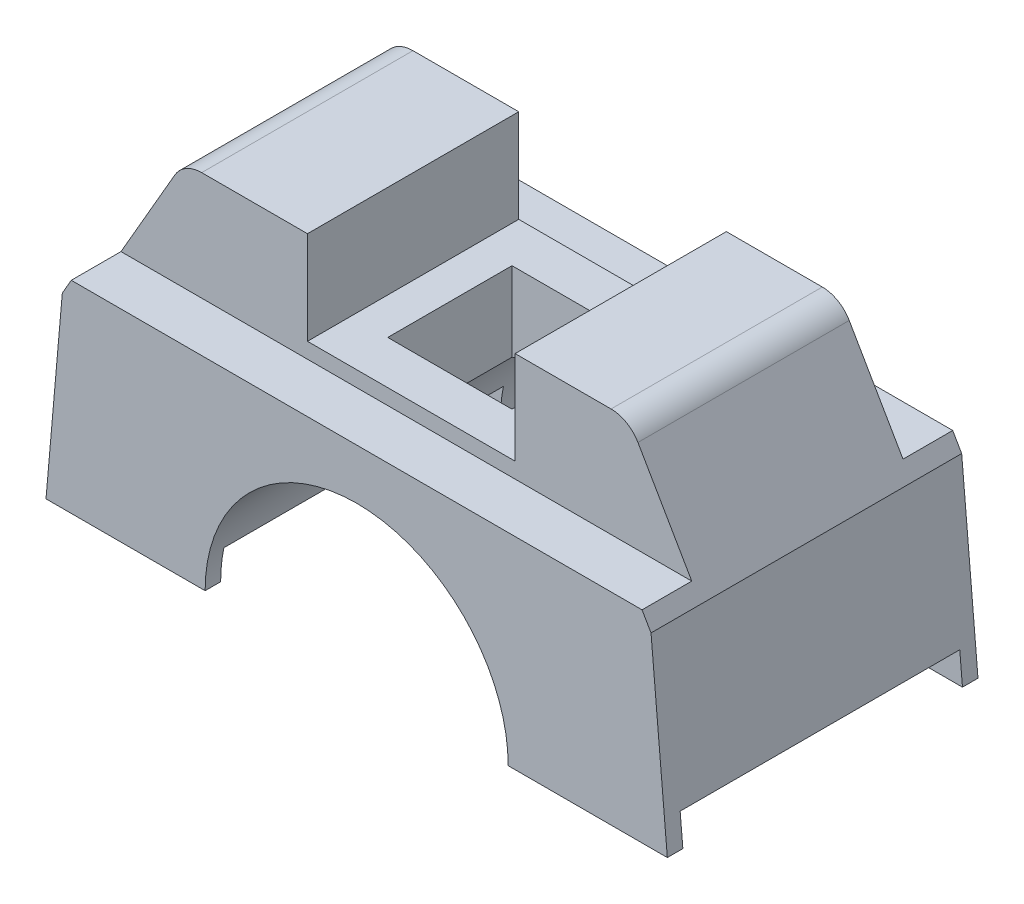
ISO-10303-21;
HEADER;
FILE_DESCRIPTION(('STEP AP214'),'2;1');
FILE_NAME('part.step','',(''),(''),'','','');
FILE_SCHEMA(('AUTOMOTIVE_DESIGN { 1 0 10303 214 1 1 1 1 }'));
ENDSEC;
DATA;
#1=APPLICATION_CONTEXT('core data for automotive mechanical design processes');
#2=APPLICATION_PROTOCOL_DEFINITION('international standard','automotive_design',2000,#1);
#3=PRODUCT_CONTEXT('',#1,'mechanical');
#4=PRODUCT('Part','Part','',(#3));
#5=PRODUCT_RELATED_PRODUCT_CATEGORY('part','',(#4));
#6=PRODUCT_DEFINITION_FORMATION('','',#4);
#7=PRODUCT_DEFINITION_CONTEXT('part definition',#1,'design');
#8=PRODUCT_DEFINITION('design','',#6,#7);
#9=PRODUCT_DEFINITION_SHAPE('','',#8);
#10=(LENGTH_UNIT() NAMED_UNIT(*) SI_UNIT(.MILLI.,.METRE.));
#11=(NAMED_UNIT(*) PLANE_ANGLE_UNIT() SI_UNIT($,.RADIAN.));
#12=(NAMED_UNIT(*) SI_UNIT($,.STERADIAN.) SOLID_ANGLE_UNIT());
#13=UNCERTAINTY_MEASURE_WITH_UNIT(LENGTH_MEASURE(1.E-05),#10,'distance_accuracy_value','');
#14=(GEOMETRIC_REPRESENTATION_CONTEXT(3) GLOBAL_UNCERTAINTY_ASSIGNED_CONTEXT((#13)) GLOBAL_UNIT_ASSIGNED_CONTEXT((#10,
#11,#12)) REPRESENTATION_CONTEXT('',''));
#15=CARTESIAN_POINT('',(0.,0.,0.));
#16=DIRECTION('',(0.,0.,1.));
#17=DIRECTION('',(1.,0.,0.));
#18=AXIS2_PLACEMENT_3D('',#15,#16,#17);
#19=CARTESIAN_POINT('',(0.,0.,25.));
#20=DIRECTION('',(0.,0.,-1.));
#21=DIRECTION('',(-1.,0.,0.));
#22=AXIS2_PLACEMENT_3D('',#19,#20,#21);
#23=CYLINDRICAL_SURFACE('',#22,24.39);
#24=DIRECTION('',(0.,0.,-1.));
#25=VECTOR('',#24,1.);
#26=CARTESIAN_POINT('',(-10.,22.2457209368454,25.));
#27=LINE('',#26,#25);
#28=CARTESIAN_POINT('',(-10.,22.2457209368454,10.));
#29=VERTEX_POINT('',#28);
#30=CARTESIAN_POINT('',(-10.,22.2457209368454,-10.));
#31=VERTEX_POINT('',#30);
#32=EDGE_CURVE('E321',#29,#31,#27,.T.);
#33=ORIENTED_EDGE('',*,*,#32,.F.);
#34=CARTESIAN_POINT('',(0.,0.,10.));
#35=DIRECTION('',(0.,0.,1.));
#36=DIRECTION('',(1.,0.,0.));
#37=AXIS2_PLACEMENT_3D('',#34,#35,#36);
#38=CIRCLE('',#37,24.39);
#39=CARTESIAN_POINT('',(10.,22.2457209368454,10.));
#40=VERTEX_POINT('',#39);
#41=EDGE_CURVE('E301',#40,#29,#38,.T.);
#42=ORIENTED_EDGE('',*,*,#41,.F.);
#43=DIRECTION('',(0.,0.,-1.));
#44=VECTOR('',#43,1.);
#45=CARTESIAN_POINT('',(10.,22.2457209368454,25.));
#46=LINE('',#45,#44);
#47=CARTESIAN_POINT('',(9.99999999999999,22.2457209368454,-10.));
#48=VERTEX_POINT('',#47);
#49=EDGE_CURVE('E314',#48,#40,#46,.F.);
#50=ORIENTED_EDGE('',*,*,#49,.F.);
#51=CARTESIAN_POINT('',(0.,0.,-10.));
#52=DIRECTION('',(0.,0.,-1.));
#53=DIRECTION('',(-1.,0.,0.));
#54=AXIS2_PLACEMENT_3D('',#51,#52,#53);
#55=CIRCLE('',#54,24.39);
#56=EDGE_CURVE('E318',#31,#48,#55,.T.);
#57=ORIENTED_EDGE('',*,*,#56,.F.);
#58=EDGE_LOOP('',(#33,#42,#50,#57));
#59=FACE_BOUND('',#58,.T.);
#60=DIRECTION('',(0.,0.,-1.));
#61=VECTOR('',#60,1.);
#62=CARTESIAN_POINT('',(-23.871994051608,4.99999999999917,25.));
#63=LINE('',#62,#61);
#64=CARTESIAN_POINT('',(-23.871994051608,4.99999999999917,22.5));
#65=VERTEX_POINT('',#64);
#66=CARTESIAN_POINT('',(-23.871994051608,4.99999999999917,-22.5));
#67=VERTEX_POINT('',#66);
#68=EDGE_CURVE('E56',#65,#67,#63,.T.);
#69=ORIENTED_EDGE('',*,*,#68,.T.);
#70=CARTESIAN_POINT('',(0.,0.,-22.5));
#71=DIRECTION('',(0.,0.,1.));
#72=DIRECTION('',(1.,0.,0.));
#73=AXIS2_PLACEMENT_3D('',#70,#71,#72);
#74=CIRCLE('',#73,24.39);
#75=CARTESIAN_POINT('',(-24.39,0.,-22.5));
#76=VERTEX_POINT('',#75);
#77=EDGE_CURVE('E284',#67,#76,#74,.T.);
#78=ORIENTED_EDGE('',*,*,#77,.T.);
#79=DIRECTION('',(0.,0.,-1.));
#80=VECTOR('',#79,1.);
#81=CARTESIAN_POINT('',(-24.39,0.,25.));
#82=LINE('',#81,#80);
#83=CARTESIAN_POINT('',(-24.39,0.,-25.));
#84=VERTEX_POINT('',#83);
#85=EDGE_CURVE('E455',#76,#84,#82,.T.);
#86=ORIENTED_EDGE('',*,*,#85,.T.);
#87=CARTESIAN_POINT('',(0.,0.,-25.));
#88=DIRECTION('',(0.,0.,1.));
#89=DIRECTION('',(1.,0.,0.));
#90=AXIS2_PLACEMENT_3D('',#87,#88,#89);
#91=CIRCLE('',#90,24.39);
#92=CARTESIAN_POINT('',(24.39,-4.06410084483682E-13,-25.));
#93=VERTEX_POINT('',#92);
#94=EDGE_CURVE('E425',#93,#84,#91,.T.);
#95=ORIENTED_EDGE('',*,*,#94,.F.);
#96=DIRECTION('',(0.,0.,-1.));
#97=VECTOR('',#96,1.);
#98=CARTESIAN_POINT('',(24.39,-4.06410084483682E-13,25.));
#99=LINE('',#98,#97);
#100=CARTESIAN_POINT('',(24.39,-4.06410084483682E-13,-22.5));
#101=VERTEX_POINT('',#100);
#102=EDGE_CURVE('E247',#101,#93,#99,.T.);
#103=ORIENTED_EDGE('',*,*,#102,.F.);
#104=CARTESIAN_POINT('',(23.871994051608,4.99999999999917,-22.5));
#105=VERTEX_POINT('',#104);
#106=EDGE_CURVE('E287',#101,#105,#74,.T.);
#107=ORIENTED_EDGE('',*,*,#106,.T.);
#108=DIRECTION('',(0.,0.,-1.));
#109=VECTOR('',#108,1.);
#110=CARTESIAN_POINT('',(23.871994051608,4.99999999999917,25.));
#111=LINE('',#110,#109);
#112=CARTESIAN_POINT('',(23.871994051608,4.99999999999917,22.5));
#113=VERTEX_POINT('',#112);
#114=EDGE_CURVE('E291',#105,#113,#111,.F.);
#115=ORIENTED_EDGE('',*,*,#114,.T.);
#116=CARTESIAN_POINT('',(0.,0.,22.5));
#117=DIRECTION('',(0.,0.,-1.));
#118=DIRECTION('',(-1.,0.,0.));
#119=AXIS2_PLACEMENT_3D('',#116,#117,#118);
#120=CIRCLE('',#119,24.39);
#121=CARTESIAN_POINT('',(24.39,-4.06410084483682E-13,22.5));
#122=VERTEX_POINT('',#121);
#123=EDGE_CURVE('E266',#113,#122,#120,.T.);
#124=ORIENTED_EDGE('',*,*,#123,.T.);
#125=CARTESIAN_POINT('',(24.39,-4.06410084483682E-13,25.));
#126=VERTEX_POINT('',#125);
#127=EDGE_CURVE('E254',#126,#122,#99,.T.);
#128=ORIENTED_EDGE('',*,*,#127,.F.);
#129=CARTESIAN_POINT('',(0.,0.,25.));
#130=DIRECTION('',(0.,0.,1.));
#131=DIRECTION('',(1.,0.,0.));
#132=AXIS2_PLACEMENT_3D('',#129,#130,#131);
#133=CIRCLE('',#132,24.39);
#134=CARTESIAN_POINT('',(-24.39,0.,25.));
#135=VERTEX_POINT('',#134);
#136=EDGE_CURVE('E426',#126,#135,#133,.T.);
#137=ORIENTED_EDGE('',*,*,#136,.T.);
#138=CARTESIAN_POINT('',(-24.39,0.,22.5));
#139=VERTEX_POINT('',#138);
#140=EDGE_CURVE('E485',#135,#139,#82,.T.);
#141=ORIENTED_EDGE('',*,*,#140,.T.);
#142=EDGE_CURVE('E61',#139,#65,#120,.T.);
#143=ORIENTED_EDGE('',*,*,#142,.T.);
#144=EDGE_LOOP('',(#69,#78,#86,#95,#103,#107,#115,#124,#128,#137,#141,#143));
#145=FACE_BOUND('',#144,.T.);
#146=ADVANCED_FACE('F41',(#59,#145),#23,.F.);
#147=CARTESIAN_POINT('',(0.,0.,25.));
#148=DIRECTION('',(0.,-1.,0.));
#149=DIRECTION('',(1.,0.,0.));
#150=AXIS2_PLACEMENT_3D('',#147,#148,#149);
#151=PLANE('',#150);
#152=DIRECTION('',(0.,0.,-1.));
#153=VECTOR('',#152,1.);
#154=CARTESIAN_POINT('',(49.9999999999999,-8.33149004681594E-13,25.));
#155=LINE('',#154,#153);
#156=CARTESIAN_POINT('',(49.9999999999999,-8.33149004681594E-13,-22.5));
#157=VERTEX_POINT('',#156);
#158=CARTESIAN_POINT('',(49.9999999999999,-8.33149004681594E-13,-25.));
#159=VERTEX_POINT('',#158);
#160=EDGE_CURVE('E248',#157,#159,#155,.T.);
#161=ORIENTED_EDGE('',*,*,#160,.F.);
#162=DIRECTION('',(-1.,0.,0.));
#163=VECTOR('',#162,1.);
#164=CARTESIAN_POINT('',(210.508064450509,-8.33149004681594E-13,-22.5));
#165=LINE('',#164,#163);
#166=EDGE_CURVE('E273',#157,#101,#165,.T.);
#167=ORIENTED_EDGE('',*,*,#166,.T.);
#168=ORIENTED_EDGE('',*,*,#102,.T.);
#169=DIRECTION('',(-1.,0.,0.));
#170=VECTOR('',#169,1.);
#171=CARTESIAN_POINT('',(0.,0.,-25.));
#172=LINE('',#171,#170);
#173=EDGE_CURVE('E459',#159,#93,#172,.T.);
#174=ORIENTED_EDGE('',*,*,#173,.F.);
#175=EDGE_LOOP('',(#161,#167,#168,#174));
#176=FACE_BOUND('',#175,.T.);
#177=ADVANCED_FACE('F554',(#176),#151,.T.);
#178=CARTESIAN_POINT('',(49.6201938253051,4.34120444167299,25.));
#179=DIRECTION('',(-0.996194698091746,-0.087155742747653,0.));
#180=DIRECTION('',(0.087155742747653,-0.996194698091746,0.));
#181=AXIS2_PLACEMENT_3D('',#178,#179,#180);
#182=PLANE('',#181);
#183=DIRECTION('',(-0.087155742747653,0.996194698091746,0.));
#184=VECTOR('',#183,1.);
#185=CARTESIAN_POINT('',(49.6201938253051,4.34120444167299,-22.5));
#186=LINE('',#185,#184);
#187=CARTESIAN_POINT('',(49.5625566823704,4.99999999999917,-22.5));
#188=VERTEX_POINT('',#187);
#189=EDGE_CURVE('E280',#157,#188,#186,.T.);
#190=ORIENTED_EDGE('',*,*,#189,.F.);
#191=ORIENTED_EDGE('',*,*,#160,.T.);
#192=DIRECTION('',(-0.087155742747653,0.996194698091746,0.));
#193=VECTOR('',#192,1.);
#194=CARTESIAN_POINT('',(49.6201938253051,4.34120444167299,-25.));
#195=LINE('',#194,#193);
#196=CARTESIAN_POINT('',(47.3753400942223,30.,-25.));
#197=VERTEX_POINT('',#196);
#198=EDGE_CURVE('E463',#159,#197,#195,.T.);
#199=ORIENTED_EDGE('',*,*,#198,.T.);
#200=DIRECTION('',(0.,0.,-1.));
#201=VECTOR('',#200,1.);
#202=CARTESIAN_POINT('',(47.3753400942223,30.,25.));
#203=LINE('',#202,#201);
#204=CARTESIAN_POINT('',(47.3753400942223,30.,25.));
#205=VERTEX_POINT('',#204);
#206=EDGE_CURVE('E504',#205,#197,#203,.T.);
#207=ORIENTED_EDGE('',*,*,#206,.F.);
#208=DIRECTION('',(-0.087155742747653,0.996194698091746,0.));
#209=VECTOR('',#208,1.);
#210=CARTESIAN_POINT('',(49.6201938253051,4.34120444167299,25.));
#211=LINE('',#210,#209);
#212=CARTESIAN_POINT('',(49.9999999999999,-8.33149004681594E-13,25.));
#213=VERTEX_POINT('',#212);
#214=EDGE_CURVE('E242',#213,#205,#211,.T.);
#215=ORIENTED_EDGE('',*,*,#214,.F.);
#216=CARTESIAN_POINT('',(50.,-8.33149004681594E-13,22.5));
#217=VERTEX_POINT('',#216);
#218=EDGE_CURVE('E235',#213,#217,#155,.T.);
#219=ORIENTED_EDGE('',*,*,#218,.T.);
#220=DIRECTION('',(0.087155742747653,-0.996194698091746,0.));
#221=VECTOR('',#220,1.);
#222=CARTESIAN_POINT('',(49.6201938253051,4.34120444167299,22.5));
#223=LINE('',#222,#221);
#224=CARTESIAN_POINT('',(49.5625566823704,4.99999999999917,22.5));
#225=VERTEX_POINT('',#224);
#226=EDGE_CURVE('E239',#225,#217,#223,.T.);
#227=ORIENTED_EDGE('',*,*,#226,.F.);
#228=DIRECTION('',(0.,0.,1.));
#229=VECTOR('',#228,1.);
#230=CARTESIAN_POINT('',(49.5625566823704,4.99999999999917,25.));
#231=LINE('',#230,#229);
#232=EDGE_CURVE('E288',#188,#225,#231,.T.);
#233=ORIENTED_EDGE('',*,*,#232,.F.);
#234=EDGE_LOOP('',(#190,#191,#199,#207,#215,#219,#227,#233));
#235=FACE_BOUND('',#234,.T.);
#236=ADVANCED_FACE('F237',(#235),#182,.F.);
#237=CARTESIAN_POINT('',(-49.6201938253052,4.34120444167354,25.));
#238=DIRECTION('',(-0.996194698091745,0.0871557427476638,0.));
#239=DIRECTION('',(-0.0871557427476638,-0.996194698091745,0.));
#240=AXIS2_PLACEMENT_3D('',#237,#238,#239);
#241=PLANE('',#240);
#242=DIRECTION('',(0.,0.,-1.));
#243=VECTOR('',#242,1.);
#244=CARTESIAN_POINT('',(-50.0000000000001,0.,25.));
#245=LINE('',#244,#243);
#246=CARTESIAN_POINT('',(-50.0000000000001,0.,-22.5));
#247=VERTEX_POINT('',#246);
#248=CARTESIAN_POINT('',(-50.0000000000001,0.,-25.));
#249=VERTEX_POINT('',#248);
#250=EDGE_CURVE('E488',#247,#249,#245,.T.);
#251=ORIENTED_EDGE('',*,*,#250,.F.);
#252=DIRECTION('',(0.0871557427476638,0.996194698091745,0.));
#253=VECTOR('',#252,1.);
#254=CARTESIAN_POINT('',(-49.6201938253052,4.34120444167354,-22.5));
#255=LINE('',#254,#253);
#256=CARTESIAN_POINT('',(-49.5625566823705,4.99999999999917,-22.5));
#257=VERTEX_POINT('',#256);
#258=EDGE_CURVE('E277',#247,#257,#255,.T.);
#259=ORIENTED_EDGE('',*,*,#258,.T.);
#260=DIRECTION('',(0.,0.,1.));
#261=VECTOR('',#260,1.);
#262=CARTESIAN_POINT('',(-49.5625566823705,4.99999999999917,25.));
#263=LINE('',#262,#261);
#264=CARTESIAN_POINT('',(-49.5625566823705,4.99999999999917,22.5));
#265=VERTEX_POINT('',#264);
#266=EDGE_CURVE('E11',#257,#265,#263,.T.);
#267=ORIENTED_EDGE('',*,*,#266,.T.);
#268=DIRECTION('',(-0.0871557427476638,-0.996194698091745,0.));
#269=VECTOR('',#268,1.);
#270=CARTESIAN_POINT('',(-49.6201938253052,4.34120444167354,22.5));
#271=LINE('',#270,#269);
#272=CARTESIAN_POINT('',(-50.0000000000001,-8.33149004681594E-13,22.5));
#273=VERTEX_POINT('',#272);
#274=EDGE_CURVE('E267',#265,#273,#271,.T.);
#275=ORIENTED_EDGE('',*,*,#274,.T.);
#276=CARTESIAN_POINT('',(-50.0000000000001,0.,25.));
#277=VERTEX_POINT('',#276);
#278=EDGE_CURVE('E489',#277,#273,#245,.T.);
#279=ORIENTED_EDGE('',*,*,#278,.F.);
#280=DIRECTION('',(0.0871557427476638,0.996194698091745,0.));
#281=VECTOR('',#280,1.);
#282=CARTESIAN_POINT('',(-49.6201938253052,4.34120444167354,25.));
#283=LINE('',#282,#281);
#284=CARTESIAN_POINT('',(-47.3753400942222,30.,25.));
#285=VERTEX_POINT('',#284);
#286=EDGE_CURVE('E447',#277,#285,#283,.T.);
#287=ORIENTED_EDGE('',*,*,#286,.T.);
#288=DIRECTION('',(0.,0.,-1.));
#289=VECTOR('',#288,1.);
#290=CARTESIAN_POINT('',(-47.3753400942222,30.,25.));
#291=LINE('',#290,#289);
#292=CARTESIAN_POINT('',(-47.3753400942222,30.,-25.));
#293=VERTEX_POINT('',#292);
#294=EDGE_CURVE('E492',#285,#293,#291,.T.);
#295=ORIENTED_EDGE('',*,*,#294,.T.);
#296=DIRECTION('',(0.0871557427476638,0.996194698091745,0.));
#297=VECTOR('',#296,1.);
#298=CARTESIAN_POINT('',(-49.6201938253052,4.34120444167354,-25.));
#299=LINE('',#298,#297);
#300=EDGE_CURVE('E478',#249,#293,#299,.T.);
#301=ORIENTED_EDGE('',*,*,#300,.F.);
#302=EDGE_LOOP('',(#251,#259,#267,#275,#279,#287,#295,#301));
#303=FACE_BOUND('',#302,.T.);
#304=ADVANCED_FACE('F562',(#303),#241,.T.);
#305=CARTESIAN_POINT('',(0.,0.,25.));
#306=DIRECTION('',(0.,-1.,0.));
#307=DIRECTION('',(1.,0.,0.));
#308=AXIS2_PLACEMENT_3D('',#305,#306,#307);
#309=PLANE('',#308);
#310=ORIENTED_EDGE('',*,*,#85,.F.);
#311=EDGE_CURVE('E635',#76,#247,#165,.T.);
#312=ORIENTED_EDGE('',*,*,#311,.T.);
#313=ORIENTED_EDGE('',*,*,#250,.T.);
#314=DIRECTION('',(-1.,0.,0.));
#315=VECTOR('',#314,1.);
#316=CARTESIAN_POINT('',(0.,0.,-25.));
#317=LINE('',#316,#315);
#318=EDGE_CURVE('E431',#84,#249,#317,.T.);
#319=ORIENTED_EDGE('',*,*,#318,.F.);
#320=EDGE_LOOP('',(#310,#312,#313,#319));
#321=FACE_BOUND('',#320,.T.);
#322=ADVANCED_FACE('F575',(#321),#309,.T.);
#323=CARTESIAN_POINT('',(0.,32.5,25.));
#324=DIRECTION('',(0.,1.,0.));
#325=DIRECTION('',(0.,0.,1.));
#326=AXIS2_PLACEMENT_3D('',#323,#324,#325);
#327=PLANE('',#326);
#328=DIRECTION('',(0.,0.,-1.));
#329=VECTOR('',#328,1.);
#330=CARTESIAN_POINT('',(-45.9319644212481,32.5,25.));
#331=LINE('',#330,#329);
#332=CARTESIAN_POINT('',(-45.9319644212481,32.5,-17.));
#333=VERTEX_POINT('',#332);
#334=CARTESIAN_POINT('',(-45.9319644212481,32.5,-25.));
#335=VERTEX_POINT('',#334);
#336=EDGE_CURVE('E495',#333,#335,#331,.T.);
#337=ORIENTED_EDGE('',*,*,#336,.F.);
#338=DIRECTION('',(1.,0.,0.));
#339=VECTOR('',#338,1.);
#340=CARTESIAN_POINT('',(0.,32.5,-17.));
#341=LINE('',#340,#339);
#342=CARTESIAN_POINT('',(45.9319644212483,32.5,-17.));
#343=VERTEX_POINT('',#342);
#344=EDGE_CURVE('E372',#333,#343,#341,.T.);
#345=ORIENTED_EDGE('',*,*,#344,.T.);
#346=DIRECTION('',(0.,0.,-1.));
#347=VECTOR('',#346,1.);
#348=CARTESIAN_POINT('',(45.9319644212483,32.5,25.));
#349=LINE('',#348,#347);
#350=CARTESIAN_POINT('',(45.9319644212483,32.5,-25.));
#351=VERTEX_POINT('',#350);
#352=EDGE_CURVE('E500',#343,#351,#349,.T.);
#353=ORIENTED_EDGE('',*,*,#352,.T.);
#354=DIRECTION('',(1.,0.,0.));
#355=VECTOR('',#354,1.);
#356=CARTESIAN_POINT('',(0.,32.5,-25.));
#357=LINE('',#356,#355);
#358=EDGE_CURVE('E470',#335,#351,#357,.T.);
#359=ORIENTED_EDGE('',*,*,#358,.F.);
#360=EDGE_LOOP('',(#337,#345,#353,#359));
#361=FACE_BOUND('',#360,.T.);
#362=ADVANCED_FACE('F567',(#361),#327,.T.);
#363=DIRECTION('',(-1.,0.,0.));
#364=VECTOR('',#363,1.);
#365=CARTESIAN_POINT('',(210.508064450509,-8.33149004681594E-13,22.5));
#366=LINE('',#365,#364);
#367=EDGE_CURVE('E252',#217,#122,#366,.T.);
#368=ORIENTED_EDGE('',*,*,#367,.F.);
#369=ORIENTED_EDGE('',*,*,#218,.F.);
#370=DIRECTION('',(-1.,0.,0.));
#371=VECTOR('',#370,1.);
#372=CARTESIAN_POINT('',(0.,0.,25.));
#373=LINE('',#372,#371);
#374=EDGE_CURVE('E430',#213,#126,#373,.T.);
#375=ORIENTED_EDGE('',*,*,#374,.T.);
#376=ORIENTED_EDGE('',*,*,#127,.T.);
#377=EDGE_LOOP('',(#368,#369,#375,#376));
#378=FACE_BOUND('',#377,.T.);
#379=ADVANCED_FACE('F253',(#378),#151,.T.);
#380=CARTESIAN_POINT('',(48.5218861274333,28.014124017262,25.));
#381=DIRECTION('',(-0.866025403784438,-0.500000000000001,0.));
#382=DIRECTION('',(0.500000000000001,-0.866025403784438,0.));
#383=AXIS2_PLACEMENT_3D('',#380,#381,#382);
#384=PLANE('',#383);
#385=DIRECTION('',(-0.500000000000001,0.866025403784438,0.));
#386=VECTOR('',#385,1.);
#387=CARTESIAN_POINT('',(48.5218861274333,28.014124017262,-25.));
#388=LINE('',#387,#386);
#389=EDGE_CURVE('E466',#197,#351,#388,.T.);
#390=ORIENTED_EDGE('',*,*,#389,.T.);
#391=ORIENTED_EDGE('',*,*,#352,.F.);
#392=DIRECTION('',(-0.500000000000001,0.866025403784438,0.));
#393=VECTOR('',#392,1.);
#394=CARTESIAN_POINT('',(48.5218861274333,28.014124017262,-17.));
#395=LINE('',#394,#393);
#396=CARTESIAN_POINT('',(37.2717103834038,47.5,-17.));
#397=VERTEX_POINT('',#396);
#398=EDGE_CURVE('E375',#343,#397,#395,.T.);
#399=ORIENTED_EDGE('',*,*,#398,.T.);
#400=DIRECTION('',(0.,0.,-1.));
#401=VECTOR('',#400,1.);
#402=CARTESIAN_POINT('',(37.2717103834038,47.5,17.));
#403=LINE('',#402,#401);
#404=CARTESIAN_POINT('',(37.2717103834038,47.5,17.));
#405=VERTEX_POINT('',#404);
#406=EDGE_CURVE('E418',#405,#397,#403,.T.);
#407=ORIENTED_EDGE('',*,*,#406,.F.);
#408=DIRECTION('',(-0.500000000000001,0.866025403784438,0.));
#409=VECTOR('',#408,1.);
#410=CARTESIAN_POINT('',(48.5218861274333,28.014124017262,17.));
#411=LINE('',#410,#409);
#412=CARTESIAN_POINT('',(45.9319644212483,32.5,17.));
#413=VERTEX_POINT('',#412);
#414=EDGE_CURVE('E338',#413,#405,#411,.T.);
#415=ORIENTED_EDGE('',*,*,#414,.F.);
#416=CARTESIAN_POINT('',(45.9319644212483,32.5,25.));
#417=VERTEX_POINT('',#416);
#418=EDGE_CURVE('E501',#417,#413,#349,.T.);
#419=ORIENTED_EDGE('',*,*,#418,.F.);
#420=DIRECTION('',(-0.500000000000001,0.866025403784438,0.));
#421=VECTOR('',#420,1.);
#422=CARTESIAN_POINT('',(48.5218861274333,28.014124017262,25.));
#423=LINE('',#422,#421);
#424=EDGE_CURVE('E436',#205,#417,#423,.T.);
#425=ORIENTED_EDGE('',*,*,#424,.F.);
#426=ORIENTED_EDGE('',*,*,#206,.T.);
#427=EDGE_LOOP('',(#390,#391,#399,#407,#415,#419,#425,#426));
#428=FACE_BOUND('',#427,.T.);
#429=ADVANCED_FACE('F566',(#428),#384,.F.);
#430=DIRECTION('',(1.,0.,0.));
#431=VECTOR('',#430,1.);
#432=CARTESIAN_POINT('',(0.,32.5,17.));
#433=LINE('',#432,#431);
#434=CARTESIAN_POINT('',(-45.9319644212481,32.5,17.));
#435=VERTEX_POINT('',#434);
#436=EDGE_CURVE('E334',#435,#413,#433,.T.);
#437=ORIENTED_EDGE('',*,*,#436,.F.);
#438=CARTESIAN_POINT('',(-45.9319644212481,32.5,25.));
#439=VERTEX_POINT('',#438);
#440=EDGE_CURVE('E496',#439,#435,#331,.T.);
#441=ORIENTED_EDGE('',*,*,#440,.F.);
#442=DIRECTION('',(1.,0.,0.));
#443=VECTOR('',#442,1.);
#444=CARTESIAN_POINT('',(0.,32.5,25.));
#445=LINE('',#444,#443);
#446=EDGE_CURVE('E439',#439,#417,#445,.T.);
#447=ORIENTED_EDGE('',*,*,#446,.T.);
#448=ORIENTED_EDGE('',*,*,#418,.T.);
#449=EDGE_LOOP('',(#437,#441,#447,#448));
#450=FACE_BOUND('',#449,.T.);
#451=ADVANCED_FACE('F572',(#450),#327,.T.);
#452=CARTESIAN_POINT('',(-48.5218861274331,28.0141240172622,25.));
#453=DIRECTION('',(-0.866025403784436,0.500000000000004,0.));
#454=DIRECTION('',(-0.500000000000004,-0.866025403784436,0.));
#455=AXIS2_PLACEMENT_3D('',#452,#453,#454);
#456=PLANE('',#455);
#457=DIRECTION('',(0.500000000000004,0.866025403784436,0.));
#458=VECTOR('',#457,1.);
#459=CARTESIAN_POINT('',(-48.5218861274331,28.0141240172622,-25.));
#460=LINE('',#459,#458);
#461=EDGE_CURVE('E474',#293,#335,#460,.T.);
#462=ORIENTED_EDGE('',*,*,#461,.F.);
#463=ORIENTED_EDGE('',*,*,#294,.F.);
#464=DIRECTION('',(0.500000000000004,0.866025403784436,0.));
#465=VECTOR('',#464,1.);
#466=CARTESIAN_POINT('',(-48.5218861274331,28.0141240172622,25.));
#467=LINE('',#466,#465);
#468=EDGE_CURVE('E443',#285,#439,#467,.T.);
#469=ORIENTED_EDGE('',*,*,#468,.T.);
#470=ORIENTED_EDGE('',*,*,#440,.T.);
#471=DIRECTION('',(0.500000000000004,0.866025403784436,0.));
#472=VECTOR('',#471,1.);
#473=CARTESIAN_POINT('',(-48.5218861274331,28.0141240172622,17.));
#474=LINE('',#473,#472);
#475=CARTESIAN_POINT('',(-37.2717103834036,47.5,17.));
#476=VERTEX_POINT('',#475);
#477=EDGE_CURVE('E329',#435,#476,#474,.T.);
#478=ORIENTED_EDGE('',*,*,#477,.T.);
#479=DIRECTION('',(0.,0.,-1.));
#480=VECTOR('',#479,1.);
#481=CARTESIAN_POINT('',(-37.2717103834036,47.5,17.));
#482=LINE('',#481,#480);
#483=CARTESIAN_POINT('',(-37.2717103834036,47.5,-17.));
#484=VERTEX_POINT('',#483);
#485=EDGE_CURVE('E422',#476,#484,#482,.T.);
#486=ORIENTED_EDGE('',*,*,#485,.T.);
#487=DIRECTION('',(0.500000000000004,0.866025403784436,0.));
#488=VECTOR('',#487,1.);
#489=CARTESIAN_POINT('',(-48.5218861274331,28.0141240172622,-17.));
#490=LINE('',#489,#488);
#491=EDGE_CURVE('E368',#333,#484,#490,.T.);
#492=ORIENTED_EDGE('',*,*,#491,.F.);
#493=ORIENTED_EDGE('',*,*,#336,.T.);
#494=EDGE_LOOP('',(#462,#463,#469,#470,#478,#486,#492,#493));
#495=FACE_BOUND('',#494,.T.);
#496=ADVANCED_FACE('F586',(#495),#456,.T.);
#497=EDGE_CURVE('E259',#139,#273,#366,.T.);
#498=ORIENTED_EDGE('',*,*,#497,.F.);
#499=ORIENTED_EDGE('',*,*,#140,.F.);
#500=DIRECTION('',(-1.,0.,0.));
#501=VECTOR('',#500,1.);
#502=CARTESIAN_POINT('',(0.,0.,25.));
#503=LINE('',#502,#501);
#504=EDGE_CURVE('E451',#135,#277,#503,.T.);
#505=ORIENTED_EDGE('',*,*,#504,.T.);
#506=ORIENTED_EDGE('',*,*,#278,.T.);
#507=EDGE_LOOP('',(#498,#499,#505,#506));
#508=FACE_BOUND('',#507,.T.);
#509=ADVANCED_FACE('F583',(#508),#309,.T.);
#510=CARTESIAN_POINT('',(0.,0.,25.));
#511=DIRECTION('',(0.,0.,1.));
#512=DIRECTION('',(1.,0.,0.));
#513=AXIS2_PLACEMENT_3D('',#510,#511,#512);
#514=PLANE('',#513);
#515=ORIENTED_EDGE('',*,*,#136,.F.);
#516=ORIENTED_EDGE('',*,*,#374,.F.);
#517=ORIENTED_EDGE('',*,*,#214,.T.);
#518=ORIENTED_EDGE('',*,*,#424,.T.);
#519=ORIENTED_EDGE('',*,*,#446,.F.);
#520=ORIENTED_EDGE('',*,*,#468,.F.);
#521=ORIENTED_EDGE('',*,*,#286,.F.);
#522=ORIENTED_EDGE('',*,*,#504,.F.);
#523=EDGE_LOOP('',(#515,#516,#517,#518,#519,#520,#521,#522));
#524=FACE_BOUND('',#523,.T.);
#525=ADVANCED_FACE('F655',(#524),#514,.T.);
#526=CARTESIAN_POINT('',(0.,0.,-25.));
#527=DIRECTION('',(0.,0.,1.));
#528=DIRECTION('',(1.,0.,0.));
#529=AXIS2_PLACEMENT_3D('',#526,#527,#528);
#530=PLANE('',#529);
#531=ORIENTED_EDGE('',*,*,#94,.T.);
#532=ORIENTED_EDGE('',*,*,#318,.T.);
#533=ORIENTED_EDGE('',*,*,#300,.T.);
#534=ORIENTED_EDGE('',*,*,#461,.T.);
#535=ORIENTED_EDGE('',*,*,#358,.T.);
#536=ORIENTED_EDGE('',*,*,#389,.F.);
#537=ORIENTED_EDGE('',*,*,#198,.F.);
#538=ORIENTED_EDGE('',*,*,#173,.T.);
#539=EDGE_LOOP('',(#531,#532,#533,#534,#535,#536,#537,#538));
#540=FACE_BOUND('',#539,.T.);
#541=ADVANCED_FACE('F670',(#540),#530,.F.);
#542=CARTESIAN_POINT('',(-32.9415833644814,45.,17.));
#543=DIRECTION('',(0.,0.,-1.));
#544=DIRECTION('',(-1.,0.,0.));
#545=AXIS2_PLACEMENT_3D('',#542,#543,#544);
#546=CYLINDRICAL_SURFACE('',#545,4.99999999999998);
#547=CARTESIAN_POINT('',(-32.9415833644814,45.,-17.));
#548=DIRECTION('',(0.,0.,1.));
#549=DIRECTION('',(1.,0.,0.));
#550=AXIS2_PLACEMENT_3D('',#547,#548,#549);
#551=CIRCLE('',#550,4.99999999999998);
#552=CARTESIAN_POINT('',(-32.9415833644815,50.,-17.));
#553=VERTEX_POINT('',#552);
#554=EDGE_CURVE('E324',#484,#553,#551,.F.);
#555=ORIENTED_EDGE('',*,*,#554,.F.);
#556=ORIENTED_EDGE('',*,*,#485,.F.);
#557=CARTESIAN_POINT('',(-32.9415833644814,45.,17.));
#558=DIRECTION('',(0.,0.,1.));
#559=DIRECTION('',(1.,0.,0.));
#560=AXIS2_PLACEMENT_3D('',#557,#558,#559);
#561=CIRCLE('',#560,4.99999999999998);
#562=CARTESIAN_POINT('',(-32.9415833644815,50.,17.));
#563=VERTEX_POINT('',#562);
#564=EDGE_CURVE('E325',#476,#563,#561,.F.);
#565=ORIENTED_EDGE('',*,*,#564,.T.);
#566=DIRECTION('',(0.,0.,-1.));
#567=VECTOR('',#566,1.);
#568=CARTESIAN_POINT('',(-32.9415833644815,50.,17.));
#569=LINE('',#568,#567);
#570=EDGE_CURVE('E364',#563,#553,#569,.T.);
#571=ORIENTED_EDGE('',*,*,#570,.T.);
#572=EDGE_LOOP('',(#555,#556,#565,#571));
#573=FACE_BOUND('',#572,.T.);
#574=ADVANCED_FACE('F605',(#573),#546,.T.);
#575=CARTESIAN_POINT('',(32.9415833644818,45.,17.));
#576=DIRECTION('',(0.,0.,-1.));
#577=DIRECTION('',(-1.,0.,0.));
#578=AXIS2_PLACEMENT_3D('',#575,#576,#577);
#579=CYLINDRICAL_SURFACE('',#578,4.99999999999995);
#580=CARTESIAN_POINT('',(32.9415833644818,45.,-17.));
#581=DIRECTION('',(0.,0.,1.));
#582=DIRECTION('',(1.,0.,0.));
#583=AXIS2_PLACEMENT_3D('',#580,#581,#582);
#584=CIRCLE('',#583,4.99999999999995);
#585=CARTESIAN_POINT('',(32.9415833644816,50.,-17.));
#586=VERTEX_POINT('',#585);
#587=EDGE_CURVE('E378',#397,#586,#584,.T.);
#588=ORIENTED_EDGE('',*,*,#587,.T.);
#589=DIRECTION('',(0.,0.,-1.));
#590=VECTOR('',#589,1.);
#591=CARTESIAN_POINT('',(32.9415833644816,50.,17.));
#592=LINE('',#591,#590);
#593=CARTESIAN_POINT('',(32.9415833644816,50.,17.));
#594=VERTEX_POINT('',#593);
#595=EDGE_CURVE('E415',#594,#586,#592,.T.);
#596=ORIENTED_EDGE('',*,*,#595,.F.);
#597=CARTESIAN_POINT('',(32.9415833644818,45.,17.));
#598=DIRECTION('',(0.,0.,1.));
#599=DIRECTION('',(1.,0.,0.));
#600=AXIS2_PLACEMENT_3D('',#597,#598,#599);
#601=CIRCLE('',#600,4.99999999999995);
#602=EDGE_CURVE('E341',#405,#594,#601,.T.);
#603=ORIENTED_EDGE('',*,*,#602,.F.);
#604=ORIENTED_EDGE('',*,*,#406,.T.);
#605=EDGE_LOOP('',(#588,#596,#603,#604));
#606=FACE_BOUND('',#605,.T.);
#607=ADVANCED_FACE('F681',(#606),#579,.T.);
#608=CARTESIAN_POINT('',(0.,50.,17.));
#609=DIRECTION('',(0.,1.,0.));
#610=DIRECTION('',(-1.,0.,0.));
#611=AXIS2_PLACEMENT_3D('',#608,#609,#610);
#612=PLANE('',#611);
#613=DIRECTION('',(1.,0.,0.));
#614=VECTOR('',#613,1.);
#615=CARTESIAN_POINT('',(0.,50.,-17.));
#616=LINE('',#615,#614);
#617=CARTESIAN_POINT('',(17.5,50.,-17.));
#618=VERTEX_POINT('',#617);
#619=EDGE_CURVE('E382',#618,#586,#616,.T.);
#620=ORIENTED_EDGE('',*,*,#619,.F.);
#621=DIRECTION('',(0.,0.,-1.));
#622=VECTOR('',#621,1.);
#623=CARTESIAN_POINT('',(17.5,50.,17.));
#624=LINE('',#623,#622);
#625=CARTESIAN_POINT('',(17.5,50.,17.));
#626=VERTEX_POINT('',#625);
#627=EDGE_CURVE('E412',#626,#618,#624,.T.);
#628=ORIENTED_EDGE('',*,*,#627,.F.);
#629=DIRECTION('',(1.,0.,0.));
#630=VECTOR('',#629,1.);
#631=CARTESIAN_POINT('',(0.,50.,17.));
#632=LINE('',#631,#630);
#633=EDGE_CURVE('E344',#626,#594,#632,.T.);
#634=ORIENTED_EDGE('',*,*,#633,.T.);
#635=ORIENTED_EDGE('',*,*,#595,.T.);
#636=EDGE_LOOP('',(#620,#628,#634,#635));
#637=FACE_BOUND('',#636,.T.);
#638=ADVANCED_FACE('F684',(#637),#612,.T.);
#639=CARTESIAN_POINT('',(17.5,0.,17.));
#640=DIRECTION('',(-1.,0.,0.));
#641=DIRECTION('',(0.,0.,1.));
#642=AXIS2_PLACEMENT_3D('',#639,#640,#641);
#643=PLANE('',#642);
#644=DIRECTION('',(0.,1.,0.));
#645=VECTOR('',#644,1.);
#646=CARTESIAN_POINT('',(17.5,0.,-17.));
#647=LINE('',#646,#645);
#648=CARTESIAN_POINT('',(17.5,35.,-17.));
#649=VERTEX_POINT('',#648);
#650=EDGE_CURVE('E386',#649,#618,#647,.T.);
#651=ORIENTED_EDGE('',*,*,#650,.F.);
#652=DIRECTION('',(0.,0.,-1.));
#653=VECTOR('',#652,1.);
#654=CARTESIAN_POINT('',(17.5,35.,17.));
#655=LINE('',#654,#653);
#656=CARTESIAN_POINT('',(17.5,35.,17.));
#657=VERTEX_POINT('',#656);
#658=EDGE_CURVE('E409',#657,#649,#655,.T.);
#659=ORIENTED_EDGE('',*,*,#658,.F.);
#660=DIRECTION('',(0.,1.,0.));
#661=VECTOR('',#660,1.);
#662=CARTESIAN_POINT('',(17.5,0.,17.));
#663=LINE('',#662,#661);
#664=EDGE_CURVE('E348',#657,#626,#663,.T.);
#665=ORIENTED_EDGE('',*,*,#664,.T.);
#666=ORIENTED_EDGE('',*,*,#627,.T.);
#667=EDGE_LOOP('',(#651,#659,#665,#666));
#668=FACE_BOUND('',#667,.T.);
#669=ADVANCED_FACE('F687',(#668),#643,.T.);
#670=CARTESIAN_POINT('',(0.,35.,17.));
#671=DIRECTION('',(0.,1.,0.));
#672=DIRECTION('',(-1.,0.,0.));
#673=AXIS2_PLACEMENT_3D('',#670,#671,#672);
#674=PLANE('',#673);
#675=DIRECTION('',(0.,0.,1.));
#676=VECTOR('',#675,1.);
#677=CARTESIAN_POINT('',(-10.,35.,17.));
#678=LINE('',#677,#676);
#679=CARTESIAN_POINT('',(-10.,35.,-10.));
#680=VERTEX_POINT('',#679);
#681=CARTESIAN_POINT('',(-10.,35.,10.));
#682=VERTEX_POINT('',#681);
#683=EDGE_CURVE('E49',#680,#682,#678,.T.);
#684=ORIENTED_EDGE('',*,*,#683,.F.);
#685=DIRECTION('',(-1.,0.,0.));
#686=VECTOR('',#685,1.);
#687=CARTESIAN_POINT('',(0.,35.,-10.));
#688=LINE('',#687,#686);
#689=CARTESIAN_POINT('',(9.99999999999999,35.,-10.));
#690=VERTEX_POINT('',#689);
#691=EDGE_CURVE('E516',#690,#680,#688,.T.);
#692=ORIENTED_EDGE('',*,*,#691,.F.);
#693=DIRECTION('',(0.,0.,-1.));
#694=VECTOR('',#693,1.);
#695=CARTESIAN_POINT('',(9.99999999999999,35.,17.));
#696=LINE('',#695,#694);
#697=CARTESIAN_POINT('',(9.99999999999999,35.,10.));
#698=VERTEX_POINT('',#697);
#699=EDGE_CURVE('E513',#698,#690,#696,.T.);
#700=ORIENTED_EDGE('',*,*,#699,.F.);
#701=DIRECTION('',(1.,0.,0.));
#702=VECTOR('',#701,1.);
#703=CARTESIAN_POINT('',(0.,35.,10.));
#704=LINE('',#703,#702);
#705=EDGE_CURVE('E510',#682,#698,#704,.T.);
#706=ORIENTED_EDGE('',*,*,#705,.F.);
#707=EDGE_LOOP('',(#684,#692,#700,#706));
#708=FACE_BOUND('',#707,.T.);
#709=DIRECTION('',(1.,0.,0.));
#710=VECTOR('',#709,1.);
#711=CARTESIAN_POINT('',(0.,35.,-17.));
#712=LINE('',#711,#710);
#713=CARTESIAN_POINT('',(-15.9171580971967,35.,-17.));
#714=VERTEX_POINT('',#713);
#715=EDGE_CURVE('E390',#714,#649,#712,.T.);
#716=ORIENTED_EDGE('',*,*,#715,.F.);
#717=DIRECTION('',(0.,0.,-1.));
#718=VECTOR('',#717,1.);
#719=CARTESIAN_POINT('',(-15.9171580971967,35.,17.));
#720=LINE('',#719,#718);
#721=CARTESIAN_POINT('',(-15.9171580971967,35.,17.));
#722=VERTEX_POINT('',#721);
#723=EDGE_CURVE('E406',#722,#714,#720,.T.);
#724=ORIENTED_EDGE('',*,*,#723,.F.);
#725=DIRECTION('',(1.,0.,0.));
#726=VECTOR('',#725,1.);
#727=CARTESIAN_POINT('',(0.,35.,17.));
#728=LINE('',#727,#726);
#729=EDGE_CURVE('E352',#722,#657,#728,.T.);
#730=ORIENTED_EDGE('',*,*,#729,.T.);
#731=ORIENTED_EDGE('',*,*,#658,.T.);
#732=EDGE_LOOP('',(#716,#724,#730,#731));
#733=FACE_BOUND('',#732,.T.);
#734=ADVANCED_FACE('F530',(#708,#733),#674,.T.);
#735=CARTESIAN_POINT('',(-15.9171580971967,0.,17.));
#736=DIRECTION('',(1.,0.,0.));
#737=DIRECTION('',(0.,1.,0.));
#738=AXIS2_PLACEMENT_3D('',#735,#736,#737);
#739=PLANE('',#738);
#740=DIRECTION('',(0.,-1.,0.));
#741=VECTOR('',#740,1.);
#742=CARTESIAN_POINT('',(-15.9171580971967,0.,-17.));
#743=LINE('',#742,#741);
#744=CARTESIAN_POINT('',(-15.9171580971967,50.,-17.));
#745=VERTEX_POINT('',#744);
#746=EDGE_CURVE('E394',#745,#714,#743,.T.);
#747=ORIENTED_EDGE('',*,*,#746,.F.);
#748=DIRECTION('',(0.,0.,-1.));
#749=VECTOR('',#748,1.);
#750=CARTESIAN_POINT('',(-15.9171580971967,50.,17.));
#751=LINE('',#750,#749);
#752=CARTESIAN_POINT('',(-15.9171580971967,50.,17.));
#753=VERTEX_POINT('',#752);
#754=EDGE_CURVE('E403',#753,#745,#751,.T.);
#755=ORIENTED_EDGE('',*,*,#754,.F.);
#756=DIRECTION('',(0.,-1.,0.));
#757=VECTOR('',#756,1.);
#758=CARTESIAN_POINT('',(-15.9171580971967,0.,17.));
#759=LINE('',#758,#757);
#760=EDGE_CURVE('E356',#753,#722,#759,.T.);
#761=ORIENTED_EDGE('',*,*,#760,.T.);
#762=ORIENTED_EDGE('',*,*,#723,.T.);
#763=EDGE_LOOP('',(#747,#755,#761,#762));
#764=FACE_BOUND('',#763,.T.);
#765=ADVANCED_FACE('F692',(#764),#739,.T.);
#766=CARTESIAN_POINT('',(0.,50.,17.));
#767=DIRECTION('',(0.,1.,0.));
#768=DIRECTION('',(-1.,0.,0.));
#769=AXIS2_PLACEMENT_3D('',#766,#767,#768);
#770=PLANE('',#769);
#771=DIRECTION('',(1.,0.,0.));
#772=VECTOR('',#771,1.);
#773=CARTESIAN_POINT('',(0.,50.,-17.));
#774=LINE('',#773,#772);
#775=EDGE_CURVE('E330',#553,#745,#774,.T.);
#776=ORIENTED_EDGE('',*,*,#775,.F.);
#777=ORIENTED_EDGE('',*,*,#570,.F.);
#778=DIRECTION('',(1.,0.,0.));
#779=VECTOR('',#778,1.);
#780=CARTESIAN_POINT('',(0.,50.,17.));
#781=LINE('',#780,#779);
#782=EDGE_CURVE('E360',#563,#753,#781,.T.);
#783=ORIENTED_EDGE('',*,*,#782,.T.);
#784=ORIENTED_EDGE('',*,*,#754,.T.);
#785=EDGE_LOOP('',(#776,#777,#783,#784));
#786=FACE_BOUND('',#785,.T.);
#787=ADVANCED_FACE('F694',(#786),#770,.T.);
#788=CARTESIAN_POINT('',(0.,0.,17.));
#789=DIRECTION('',(0.,0.,1.));
#790=DIRECTION('',(1.,0.,0.));
#791=AXIS2_PLACEMENT_3D('',#788,#789,#790);
#792=PLANE('',#791);
#793=ORIENTED_EDGE('',*,*,#564,.F.);
#794=ORIENTED_EDGE('',*,*,#477,.F.);
#795=ORIENTED_EDGE('',*,*,#436,.T.);
#796=ORIENTED_EDGE('',*,*,#414,.T.);
#797=ORIENTED_EDGE('',*,*,#602,.T.);
#798=ORIENTED_EDGE('',*,*,#633,.F.);
#799=ORIENTED_EDGE('',*,*,#664,.F.);
#800=ORIENTED_EDGE('',*,*,#729,.F.);
#801=ORIENTED_EDGE('',*,*,#760,.F.);
#802=ORIENTED_EDGE('',*,*,#782,.F.);
#803=EDGE_LOOP('',(#793,#794,#795,#796,#797,#798,#799,#800,#801,#802));
#804=FACE_BOUND('',#803,.T.);
#805=ADVANCED_FACE('F600',(#804),#792,.T.);
#806=CARTESIAN_POINT('',(0.,0.,-17.));
#807=DIRECTION('',(0.,0.,1.));
#808=DIRECTION('',(1.,0.,0.));
#809=AXIS2_PLACEMENT_3D('',#806,#807,#808);
#810=PLANE('',#809);
#811=ORIENTED_EDGE('',*,*,#554,.T.);
#812=ORIENTED_EDGE('',*,*,#775,.T.);
#813=ORIENTED_EDGE('',*,*,#746,.T.);
#814=ORIENTED_EDGE('',*,*,#715,.T.);
#815=ORIENTED_EDGE('',*,*,#650,.T.);
#816=ORIENTED_EDGE('',*,*,#619,.T.);
#817=ORIENTED_EDGE('',*,*,#587,.F.);
#818=ORIENTED_EDGE('',*,*,#398,.F.);
#819=ORIENTED_EDGE('',*,*,#344,.F.);
#820=ORIENTED_EDGE('',*,*,#491,.T.);
#821=EDGE_LOOP('',(#811,#812,#813,#814,#815,#816,#817,#818,#819,#820));
#822=FACE_BOUND('',#821,.T.);
#823=ADVANCED_FACE('F550',(#822),#810,.F.);
#824=CARTESIAN_POINT('',(-10.,-8.39606162372775E-13,-10.));
#825=DIRECTION('',(-1.,0.,0.));
#826=DIRECTION('',(0.,-1.,0.));
#827=AXIS2_PLACEMENT_3D('',#824,#825,#826);
#828=PLANE('',#827);
#829=ORIENTED_EDGE('',*,*,#32,.T.);
#830=DIRECTION('',(0.,1.,0.));
#831=VECTOR('',#830,1.);
#832=CARTESIAN_POINT('',(-10.,-8.39606162372775E-13,-10.));
#833=LINE('',#832,#831);
#834=EDGE_CURVE('E297',#31,#680,#833,.T.);
#835=ORIENTED_EDGE('',*,*,#834,.T.);
#836=ORIENTED_EDGE('',*,*,#683,.T.);
#837=DIRECTION('',(0.,1.,0.));
#838=VECTOR('',#837,1.);
#839=CARTESIAN_POINT('',(-10.,-8.39606162372775E-13,10.));
#840=LINE('',#839,#838);
#841=EDGE_CURVE('E296',#29,#682,#840,.T.);
#842=ORIENTED_EDGE('',*,*,#841,.F.);
#843=EDGE_LOOP('',(#829,#835,#836,#842));
#844=FACE_BOUND('',#843,.T.);
#845=ADVANCED_FACE('F524',(#844),#828,.F.);
#846=CARTESIAN_POINT('',(-10.,-8.39606162372775E-13,-10.));
#847=DIRECTION('',(0.,0.,-1.));
#848=DIRECTION('',(-1.,0.,0.));
#849=AXIS2_PLACEMENT_3D('',#846,#847,#848);
#850=PLANE('',#849);
#851=ORIENTED_EDGE('',*,*,#56,.T.);
#852=DIRECTION('',(0.,1.,0.));
#853=VECTOR('',#852,1.);
#854=CARTESIAN_POINT('',(10.,-8.39606162372775E-13,-10.));
#855=LINE('',#854,#853);
#856=EDGE_CURVE('E302',#48,#690,#855,.T.);
#857=ORIENTED_EDGE('',*,*,#856,.T.);
#858=ORIENTED_EDGE('',*,*,#691,.T.);
#859=ORIENTED_EDGE('',*,*,#834,.F.);
#860=EDGE_LOOP('',(#851,#857,#858,#859));
#861=FACE_BOUND('',#860,.T.);
#862=ADVANCED_FACE('F542',(#861),#850,.F.);
#863=CARTESIAN_POINT('',(10.,-8.39606162372775E-13,-10.));
#864=DIRECTION('',(1.,0.,0.));
#865=DIRECTION('',(0.,1.,0.));
#866=AXIS2_PLACEMENT_3D('',#863,#864,#865);
#867=PLANE('',#866);
#868=ORIENTED_EDGE('',*,*,#49,.T.);
#869=DIRECTION('',(0.,1.,0.));
#870=VECTOR('',#869,1.);
#871=CARTESIAN_POINT('',(10.,-8.39606162372775E-13,10.));
#872=LINE('',#871,#870);
#873=EDGE_CURVE('E306',#40,#698,#872,.T.);
#874=ORIENTED_EDGE('',*,*,#873,.T.);
#875=ORIENTED_EDGE('',*,*,#699,.T.);
#876=ORIENTED_EDGE('',*,*,#856,.F.);
#877=EDGE_LOOP('',(#868,#874,#875,#876));
#878=FACE_BOUND('',#877,.T.);
#879=ADVANCED_FACE('F535',(#878),#867,.F.);
#880=CARTESIAN_POINT('',(10.,-8.39606162372775E-13,10.));
#881=DIRECTION('',(0.,0.,1.));
#882=DIRECTION('',(1.,0.,0.));
#883=AXIS2_PLACEMENT_3D('',#880,#881,#882);
#884=PLANE('',#883);
#885=ORIENTED_EDGE('',*,*,#41,.T.);
#886=ORIENTED_EDGE('',*,*,#841,.T.);
#887=ORIENTED_EDGE('',*,*,#705,.T.);
#888=ORIENTED_EDGE('',*,*,#873,.F.);
#889=EDGE_LOOP('',(#885,#886,#887,#888));
#890=FACE_BOUND('',#889,.T.);
#891=ADVANCED_FACE('F533',(#890),#884,.F.);
#892=CARTESIAN_POINT('',(210.508064450509,4.99999999999917,-22.5));
#893=DIRECTION('',(0.,0.,1.));
#894=DIRECTION('',(1.,0.,0.));
#895=AXIS2_PLACEMENT_3D('',#892,#893,#894);
#896=PLANE('',#895);
#897=ORIENTED_EDGE('',*,*,#77,.F.);
#898=DIRECTION('',(-1.,0.,0.));
#899=VECTOR('',#898,1.);
#900=CARTESIAN_POINT('',(210.508064450509,4.99999999999917,-22.5));
#901=LINE('',#900,#899);
#902=EDGE_CURVE('E636',#67,#257,#901,.T.);
#903=ORIENTED_EDGE('',*,*,#902,.T.);
#904=ORIENTED_EDGE('',*,*,#258,.F.);
#905=ORIENTED_EDGE('',*,*,#311,.F.);
#906=EDGE_LOOP('',(#897,#903,#904,#905));
#907=FACE_BOUND('',#906,.T.);
#908=ADVANCED_FACE('F665',(#907),#896,.T.);
#909=CARTESIAN_POINT('',(210.508064450509,-8.33149004681594E-13,22.5));
#910=DIRECTION('',(0.,0.,-1.));
#911=DIRECTION('',(-1.,0.,0.));
#912=AXIS2_PLACEMENT_3D('',#909,#910,#911);
#913=PLANE('',#912);
#914=ORIENTED_EDGE('',*,*,#142,.F.);
#915=ORIENTED_EDGE('',*,*,#497,.T.);
#916=ORIENTED_EDGE('',*,*,#274,.F.);
#917=DIRECTION('',(-1.,0.,0.));
#918=VECTOR('',#917,1.);
#919=CARTESIAN_POINT('',(210.508064450509,4.99999999999917,22.5));
#920=LINE('',#919,#918);
#921=EDGE_CURVE('E258',#65,#265,#920,.T.);
#922=ORIENTED_EDGE('',*,*,#921,.F.);
#923=EDGE_LOOP('',(#914,#915,#916,#922));
#924=FACE_BOUND('',#923,.T.);
#925=ADVANCED_FACE('F648',(#924),#913,.T.);
#926=CARTESIAN_POINT('',(210.508064450509,4.99999999999917,22.5));
#927=DIRECTION('',(0.,-1.,0.));
#928=DIRECTION('',(0.,0.,-1.));
#929=AXIS2_PLACEMENT_3D('',#926,#927,#928);
#930=PLANE('',#929);
#931=ORIENTED_EDGE('',*,*,#68,.F.);
#932=ORIENTED_EDGE('',*,*,#921,.T.);
#933=ORIENTED_EDGE('',*,*,#266,.F.);
#934=ORIENTED_EDGE('',*,*,#902,.F.);
#935=EDGE_LOOP('',(#931,#932,#933,#934));
#936=FACE_BOUND('',#935,.T.);
#937=ADVANCED_FACE('F663',(#936),#930,.T.);
#938=ORIENTED_EDGE('',*,*,#114,.F.);
#939=EDGE_CURVE('E632',#188,#105,#901,.T.);
#940=ORIENTED_EDGE('',*,*,#939,.F.);
#941=ORIENTED_EDGE('',*,*,#232,.T.);
#942=EDGE_CURVE('E264',#225,#113,#920,.T.);
#943=ORIENTED_EDGE('',*,*,#942,.T.);
#944=EDGE_LOOP('',(#938,#940,#941,#943));
#945=FACE_BOUND('',#944,.T.);
#946=ADVANCED_FACE('F631',(#945),#930,.T.);
#947=ORIENTED_EDGE('',*,*,#106,.F.);
#948=ORIENTED_EDGE('',*,*,#166,.F.);
#949=ORIENTED_EDGE('',*,*,#189,.T.);
#950=ORIENTED_EDGE('',*,*,#939,.T.);
#951=EDGE_LOOP('',(#947,#948,#949,#950));
#952=FACE_BOUND('',#951,.T.);
#953=ADVANCED_FACE('F633',(#952),#896,.T.);
#954=ORIENTED_EDGE('',*,*,#123,.F.);
#955=ORIENTED_EDGE('',*,*,#942,.F.);
#956=ORIENTED_EDGE('',*,*,#226,.T.);
#957=ORIENTED_EDGE('',*,*,#367,.T.);
#958=EDGE_LOOP('',(#954,#955,#956,#957));
#959=FACE_BOUND('',#958,.T.);
#960=ADVANCED_FACE('F262',(#959),#913,.T.);
#961=CLOSED_SHELL('',(#146,#177,#236,#304,#322,#362,#379,#429,#451,#496,#509,#525,#541,#574,
#607,#638,#669,#734,#765,#787,#805,#823,#845,#862,#879,#891,#908,#925,#937,#946,#953,#960));
#962=MANIFOLD_SOLID_BREP('B2',#961);
#963=ADVANCED_BREP_SHAPE_REPRESENTATION('',(#18,#962),#14);
#964=SHAPE_DEFINITION_REPRESENTATION(#9,#963);
ENDSEC;
END-ISO-10303-21;
